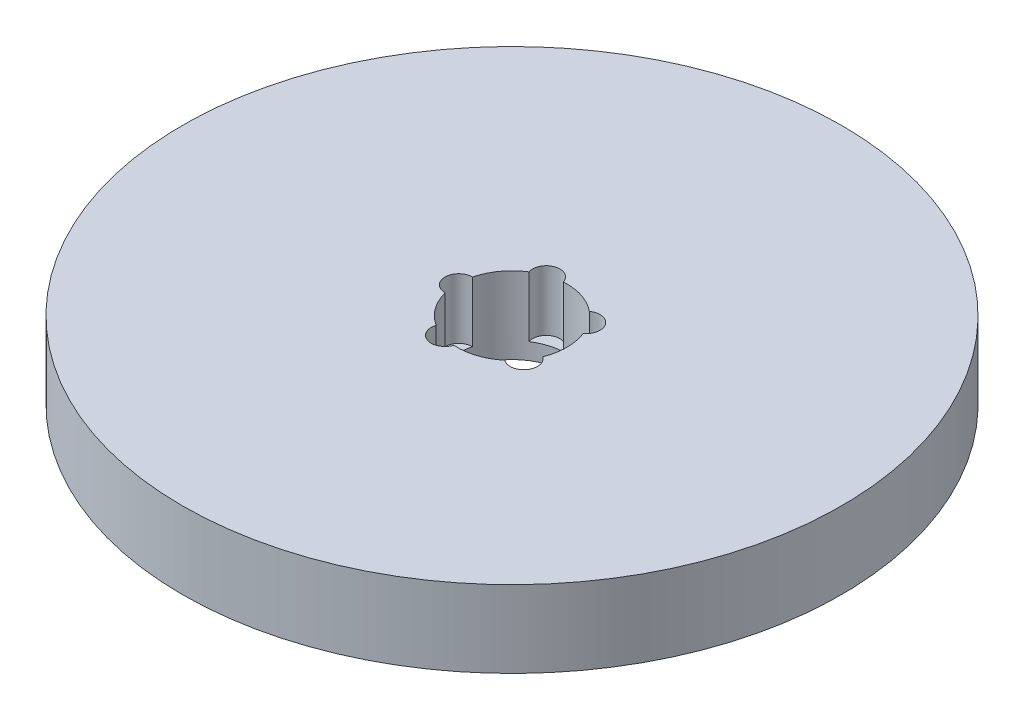
ISO-10303-21;
HEADER;
FILE_DESCRIPTION(('STEP AP214'),'2;1');
FILE_NAME('part.step','',(''),(''),'','','');
FILE_SCHEMA(('AUTOMOTIVE_DESIGN { 1 0 10303 214 1 1 1 1 }'));
ENDSEC;
DATA;
#1=APPLICATION_CONTEXT('core data for automotive mechanical design processes');
#2=APPLICATION_PROTOCOL_DEFINITION('international standard','automotive_design',2000,#1);
#3=PRODUCT_CONTEXT('',#1,'mechanical');
#4=PRODUCT('Part','Part','',(#3));
#5=PRODUCT_RELATED_PRODUCT_CATEGORY('part','',(#4));
#6=PRODUCT_DEFINITION_FORMATION('','',#4);
#7=PRODUCT_DEFINITION_CONTEXT('part definition',#1,'design');
#8=PRODUCT_DEFINITION('design','',#6,#7);
#9=PRODUCT_DEFINITION_SHAPE('','',#8);
#10=(LENGTH_UNIT() NAMED_UNIT(*) SI_UNIT(.MILLI.,.METRE.));
#11=(NAMED_UNIT(*) PLANE_ANGLE_UNIT() SI_UNIT($,.RADIAN.));
#12=(NAMED_UNIT(*) SI_UNIT($,.STERADIAN.) SOLID_ANGLE_UNIT());
#13=UNCERTAINTY_MEASURE_WITH_UNIT(LENGTH_MEASURE(1.E-05),#10,'distance_accuracy_value','');
#14=(GEOMETRIC_REPRESENTATION_CONTEXT(3) GLOBAL_UNCERTAINTY_ASSIGNED_CONTEXT((#13)) GLOBAL_UNIT_ASSIGNED_CONTEXT((#10,
#11,#12)) REPRESENTATION_CONTEXT('',''));
#15=CARTESIAN_POINT('',(0.,0.,0.));
#16=DIRECTION('',(0.,0.,1.));
#17=DIRECTION('',(1.,0.,0.));
#18=AXIS2_PLACEMENT_3D('',#15,#16,#17);
#19=CARTESIAN_POINT('',(0.,21.,0.));
#20=DIRECTION('',(0.,-1.,0.));
#21=DIRECTION('',(0.,0.,-1.));
#22=AXIS2_PLACEMENT_3D('',#19,#20,#21);
#23=CYLINDRICAL_SURFACE('',#22,90.);
#24=CARTESIAN_POINT('',(0.,21.,0.));
#25=DIRECTION('',(0.,1.,0.));
#26=DIRECTION('',(0.,0.,1.));
#27=AXIS2_PLACEMENT_3D('',#24,#25,#26);
#28=CIRCLE('',#27,90.);
#29=CARTESIAN_POINT('',(0.,21.,-90.));
#30=VERTEX_POINT('',#29);
#31=EDGE_CURVE('E157',#30,#30,#28,.T.);
#32=CARTESIAN_POINT('',(0.,0.,0.));
#33=DIRECTION('',(0.,1.,0.));
#34=DIRECTION('',(0.,0.,1.));
#35=AXIS2_PLACEMENT_3D('',#32,#33,#34);
#36=CIRCLE('',#35,90.);
#37=CARTESIAN_POINT('',(0.,0.,-90.));
#38=VERTEX_POINT('',#37);
#39=EDGE_CURVE('E150',#38,#38,#36,.T.);
#40=CARTESIAN_POINT('',(0.,21.,-90.));
#41=CARTESIAN_POINT('',(0.,20.78125,-90.));
#42=CARTESIAN_POINT('',(0.,20.5625,-90.));
#43=CARTESIAN_POINT('',(0.,20.125,-90.));
#44=CARTESIAN_POINT('',(0.,19.90625,-90.));
#45=CARTESIAN_POINT('',(0.,19.46875,-90.));
#46=CARTESIAN_POINT('',(0.,19.25,-90.));
#47=CARTESIAN_POINT('',(0.,18.8125,-90.));
#48=CARTESIAN_POINT('',(0.,18.59375,-90.));
#49=CARTESIAN_POINT('',(0.,18.15625,-90.));
#50=CARTESIAN_POINT('',(0.,17.9375,-90.));
#51=CARTESIAN_POINT('',(0.,17.5,-90.));
#52=CARTESIAN_POINT('',(0.,17.28125,-90.));
#53=CARTESIAN_POINT('',(0.,16.84375,-90.));
#54=CARTESIAN_POINT('',(0.,16.625,-90.));
#55=CARTESIAN_POINT('',(0.,16.1875,-90.));
#56=CARTESIAN_POINT('',(0.,15.96875,-90.));
#57=CARTESIAN_POINT('',(0.,15.53125,-90.));
#58=CARTESIAN_POINT('',(0.,15.3125,-90.));
#59=CARTESIAN_POINT('',(0.,14.875,-90.));
#60=CARTESIAN_POINT('',(0.,14.65625,-90.));
#61=CARTESIAN_POINT('',(0.,14.21875,-90.));
#62=CARTESIAN_POINT('',(0.,14.,-90.));
#63=CARTESIAN_POINT('',(0.,13.5625,-90.));
#64=CARTESIAN_POINT('',(0.,13.34375,-90.));
#65=CARTESIAN_POINT('',(0.,12.90625,-90.));
#66=CARTESIAN_POINT('',(0.,12.6875,-90.));
#67=CARTESIAN_POINT('',(0.,12.25,-90.));
#68=CARTESIAN_POINT('',(0.,12.03125,-90.));
#69=CARTESIAN_POINT('',(0.,11.59375,-90.));
#70=CARTESIAN_POINT('',(0.,11.375,-90.));
#71=CARTESIAN_POINT('',(0.,10.9375,-90.));
#72=CARTESIAN_POINT('',(0.,10.71875,-90.));
#73=CARTESIAN_POINT('',(0.,10.28125,-90.));
#74=CARTESIAN_POINT('',(0.,10.0625,-90.));
#75=CARTESIAN_POINT('',(0.,9.625,-90.));
#76=CARTESIAN_POINT('',(0.,9.40625,-90.));
#77=CARTESIAN_POINT('',(0.,8.96875,-90.));
#78=CARTESIAN_POINT('',(0.,8.75,-90.));
#79=CARTESIAN_POINT('',(0.,8.3125,-90.));
#80=CARTESIAN_POINT('',(0.,8.09375,-90.));
#81=CARTESIAN_POINT('',(0.,7.65625,-90.));
#82=CARTESIAN_POINT('',(0.,7.4375,-90.));
#83=CARTESIAN_POINT('',(0.,7.,-90.));
#84=CARTESIAN_POINT('',(0.,6.78125,-90.));
#85=CARTESIAN_POINT('',(0.,6.34375,-90.));
#86=CARTESIAN_POINT('',(0.,6.125,-90.));
#87=CARTESIAN_POINT('',(0.,5.6875,-90.));
#88=CARTESIAN_POINT('',(0.,5.46875,-90.));
#89=CARTESIAN_POINT('',(0.,5.03125,-90.));
#90=CARTESIAN_POINT('',(0.,4.8125,-90.));
#91=CARTESIAN_POINT('',(0.,4.375,-90.));
#92=CARTESIAN_POINT('',(0.,4.15625,-90.));
#93=CARTESIAN_POINT('',(0.,3.71875,-90.));
#94=CARTESIAN_POINT('',(0.,3.5,-90.));
#95=CARTESIAN_POINT('',(0.,3.0625,-90.));
#96=CARTESIAN_POINT('',(0.,2.84375,-90.));
#97=CARTESIAN_POINT('',(0.,2.40625,-90.));
#98=CARTESIAN_POINT('',(0.,2.1875,-90.));
#99=CARTESIAN_POINT('',(0.,1.75,-90.));
#100=CARTESIAN_POINT('',(0.,1.53125,-90.));
#101=CARTESIAN_POINT('',(0.,1.09375,-90.));
#102=CARTESIAN_POINT('',(0.,0.875000000000001,-90.));
#103=CARTESIAN_POINT('',(0.,0.4375,-90.));
#104=CARTESIAN_POINT('',(0.,0.21875,-90.));
#105=CARTESIAN_POINT('',(0.,0.,-90.));
#106=B_SPLINE_CURVE_WITH_KNOTS('',3,(#40,#41,#42,#43,#44,#45,#46,#47,#48,#49,#50,#51,#52,#53,
#54,#55,#56,#57,#58,#59,#60,#61,#62,#63,#64,#65,#66,#67,#68,#69,#70,#71,#72,#73,#74,#75,#76,#77,
#78,#79,#80,#81,#82,#83,#84,#85,#86,#87,#88,#89,#90,#91,#92,#93,#94,#95,#96,#97,#98,#99,#100,
#101,#102,#103,#104,#105),.UNSPECIFIED.,.F.,.F.,(4,2,2,2,2,2,2,2,2,2,2,2,2,2,2,2,2,2,2,2,2,2,2,
2,2,2,2,2,2,2,2,2,4),(0.,0.656250000000001,1.3125,1.96875,2.625,3.28125,3.9375,4.59375,5.25,
5.90625,6.5625,7.21875,7.875,8.53125,9.1875,9.84375,10.5,11.15625,11.8125,12.46875,13.125,
13.78125,14.4375,15.09375,15.75,16.40625,17.0625,17.71875,18.375,19.03125,19.6875,20.34375,21.),.UNSPECIFIED.);
#107=EDGE_CURVE('BSEAM39',#30,#38,#106,.T.);
#108=ORIENTED_EDGE('',*,*,#31,.F.);
#109=ORIENTED_EDGE('',*,*,#39,.T.);
#110=ORIENTED_EDGE('',*,*,#107,.T.);
#111=ORIENTED_EDGE('',*,*,#107,.F.);
#112=EDGE_LOOP('',(#108,#110,#109,#111));
#113=FACE_BOUND('',#112,.T.);
#114=ADVANCED_FACE('F39',(#113),#23,.T.);
#115=CARTESIAN_POINT('',(0.,21.,0.));
#116=DIRECTION('',(0.,1.,0.));
#117=DIRECTION('',(0.,0.,1.));
#118=AXIS2_PLACEMENT_3D('',#115,#116,#117);
#119=PLANE('',#118);
#120=CARTESIAN_POINT('',(-4.49621626958306,21.,-13.8379307924748));
#121=DIRECTION('',(0.,1.,0.));
#122=DIRECTION('',(-0.95105651629515,0.,0.309016994374958));
#123=AXIS2_PLACEMENT_3D('',#120,#121,#122);
#124=CIRCLE('',#123,3.7338312391518);
#125=CARTESIAN_POINT('',(-0.93833680600537,21.,-14.9706220324506));
#126=VERTEX_POINT('',#125);
#127=CARTESIAN_POINT('',(-8.04038042581367,21.,-12.6630281768696));
#128=VERTEX_POINT('',#127);
#129=EDGE_CURVE('E194',#126,#128,#124,.T.);
#130=ORIENTED_EDGE('',*,*,#129,.F.);
#131=CARTESIAN_POINT('',(0.,21.,0.));
#132=DIRECTION('',(0.,1.,0.));
#133=DIRECTION('',(0.,0.,1.));
#134=AXIS2_PLACEMENT_3D('',#131,#132,#133);
#135=CIRCLE('',#134,15.);
#136=CARTESIAN_POINT('',(9.55864127082486,21.,-11.5599471043636));
#137=VERTEX_POINT('',#136);
#138=EDGE_CURVE('E147',#137,#126,#135,.T.);
#139=ORIENTED_EDGE('',*,*,#138,.F.);
#140=CARTESIAN_POINT('',(11.7712470145382,21.,-8.55231156371831));
#141=DIRECTION('',(0.,1.,0.));
#142=DIRECTION('',(-0.58778525229248,0.,-0.809016994374942));
#143=AXIS2_PLACEMENT_3D('',#140,#141,#142);
#144=CIRCLE('',#143,3.7338312391518);
#145=CARTESIAN_POINT('',(13.9479456174508,21.,-5.51858795822221));
#146=VERTEX_POINT('',#145);
#147=EDGE_CURVE('E254',#146,#137,#144,.T.);
#148=ORIENTED_EDGE('',*,*,#147,.F.);
#149=CARTESIAN_POINT('',(13.9479456174509,21.,5.51858795822201));
#150=VERTEX_POINT('',#149);
#151=EDGE_CURVE('E144',#150,#146,#135,.T.);
#152=ORIENTED_EDGE('',*,*,#151,.F.);
#153=CARTESIAN_POINT('',(11.7712470145383,21.,8.55231156371814));
#154=DIRECTION('',(0.,1.,0.));
#155=DIRECTION('',(0.587785252292469,0.,-0.809016994374951));
#156=AXIS2_PLACEMENT_3D('',#153,#154,#155);
#157=CIRCLE('',#156,3.7338312391518);
#158=CARTESIAN_POINT('',(9.55864127082503,21.,11.5599471043634));
#159=VERTEX_POINT('',#158);
#160=EDGE_CURVE('E141',#159,#150,#157,.T.);
#161=ORIENTED_EDGE('',*,*,#160,.F.);
#162=CARTESIAN_POINT('',(-0.938336806005159,21.,14.9706220324506));
#163=VERTEX_POINT('',#162);
#164=EDGE_CURVE('E134',#163,#159,#135,.T.);
#165=ORIENTED_EDGE('',*,*,#164,.F.);
#166=CARTESIAN_POINT('',(-4.49621626958286,21.,13.8379307924748));
#167=DIRECTION('',(0.,1.,0.));
#168=DIRECTION('',(0.951056516295155,0.,0.309016994374945));
#169=AXIS2_PLACEMENT_3D('',#166,#167,#168);
#170=CIRCLE('',#169,3.7338312391518);
#171=CARTESIAN_POINT('',(-8.04038042581349,21.,12.6630281768697));
#172=VERTEX_POINT('',#171);
#173=EDGE_CURVE('E111',#172,#163,#170,.T.);
#174=ORIENTED_EDGE('',*,*,#173,.F.);
#175=CARTESIAN_POINT('',(-14.5278696564571,21.,3.73376529056043));
#176=VERTEX_POINT('',#175);
#177=EDGE_CURVE('E145',#176,#172,#135,.T.);
#178=ORIENTED_EDGE('',*,*,#177,.F.);
#179=CARTESIAN_POINT('',(-14.5500614899108,21.,0.));
#180=DIRECTION('',(0.,1.,0.));
#181=DIRECTION('',(0.,0.,1.));
#182=AXIS2_PLACEMENT_3D('',#179,#180,#181);
#183=CIRCLE('',#182,3.7338312391518);
#184=CARTESIAN_POINT('',(-14.5278696564571,21.,-3.73376529056043));
#185=VERTEX_POINT('',#184);
#186=EDGE_CURVE('E153',#185,#176,#183,.T.);
#187=ORIENTED_EDGE('',*,*,#186,.F.);
#188=EDGE_CURVE('E146',#128,#185,#135,.T.);
#189=ORIENTED_EDGE('',*,*,#188,.F.);
#190=EDGE_LOOP('',(#130,#139,#148,#152,#161,#165,#174,#178,#187,#189));
#191=FACE_BOUND('',#190,.T.);
#192=ORIENTED_EDGE('',*,*,#31,.T.);
#193=EDGE_LOOP('',(#192));
#194=FACE_BOUND('',#193,.T.);
#195=ADVANCED_FACE('F139',(#191,#194),#119,.T.);
#196=CARTESIAN_POINT('',(0.,0.,0.));
#197=DIRECTION('',(0.,1.,0.));
#198=DIRECTION('',(0.,0.,1.));
#199=AXIS2_PLACEMENT_3D('',#196,#197,#198);
#200=PLANE('',#199);
#201=CARTESIAN_POINT('',(0.,0.,0.));
#202=DIRECTION('',(0.,1.,0.));
#203=DIRECTION('',(0.,0.,1.));
#204=AXIS2_PLACEMENT_3D('',#201,#202,#203);
#205=CIRCLE('',#204,15.);
#206=CARTESIAN_POINT('',(0.,0.,15.));
#207=VERTEX_POINT('',#206);
#208=EDGE_CURVE('E154',#207,#207,#205,.T.);
#209=ORIENTED_EDGE('',*,*,#208,.T.);
#210=EDGE_LOOP('',(#209));
#211=FACE_BOUND('',#210,.T.);
#212=ORIENTED_EDGE('',*,*,#39,.F.);
#213=EDGE_LOOP('',(#212));
#214=FACE_BOUND('',#213,.T.);
#215=ADVANCED_FACE('F213',(#211,#214),#200,.F.);
#216=CARTESIAN_POINT('',(0.,21.,0.));
#217=DIRECTION('',(0.,-1.,0.));
#218=DIRECTION('',(0.,0.,-1.));
#219=AXIS2_PLACEMENT_3D('',#216,#217,#218);
#220=CYLINDRICAL_SURFACE('',#219,15.);
#221=DIRECTION('',(0.,1.,0.));
#222=VECTOR('',#221,1.);
#223=CARTESIAN_POINT('',(-0.938336806005371,12.7563726104581,-14.9706220324506));
#224=LINE('',#223,#222);
#225=CARTESIAN_POINT('',(-0.93833680600537,4.51274522091627,-14.9706220324506));
#226=VERTEX_POINT('',#225);
#227=EDGE_CURVE('E11',#226,#126,#224,.T.);
#228=ORIENTED_EDGE('',*,*,#227,.F.);
#229=CARTESIAN_POINT('',(0.,4.51274522091627,0.));
#230=DIRECTION('',(0.,1.,0.));
#231=DIRECTION('',(0.,0.,1.));
#232=AXIS2_PLACEMENT_3D('',#229,#230,#231);
#233=CIRCLE('',#232,15.);
#234=CARTESIAN_POINT('',(-8.04038042581367,4.51274522091627,-12.6630281768696));
#235=VERTEX_POINT('',#234);
#236=EDGE_CURVE('E189',#226,#235,#233,.T.);
#237=ORIENTED_EDGE('',*,*,#236,.T.);
#238=DIRECTION('',(0.,1.,0.));
#239=VECTOR('',#238,1.);
#240=CARTESIAN_POINT('',(-8.04038042581367,12.7563726104581,-12.6630281768696));
#241=LINE('',#240,#239);
#242=EDGE_CURVE('E46',#128,#235,#241,.F.);
#243=ORIENTED_EDGE('',*,*,#242,.F.);
#244=ORIENTED_EDGE('',*,*,#188,.T.);
#245=DIRECTION('',(0.,1.,0.));
#246=VECTOR('',#245,1.);
#247=CARTESIAN_POINT('',(-14.5278696564571,12.7563726104581,-3.73376529056043));
#248=LINE('',#247,#246);
#249=CARTESIAN_POINT('',(-14.5278696564571,4.51274522091627,-3.73376529056043));
#250=VERTEX_POINT('',#249);
#251=EDGE_CURVE('E168',#250,#185,#248,.T.);
#252=ORIENTED_EDGE('',*,*,#251,.F.);
#253=CARTESIAN_POINT('',(0.,4.51274522091627,0.));
#254=DIRECTION('',(0.,1.,0.));
#255=DIRECTION('',(0.,0.,1.));
#256=AXIS2_PLACEMENT_3D('',#253,#254,#255);
#257=CIRCLE('',#256,15.);
#258=CARTESIAN_POINT('',(-14.5278696564571,4.51274522091627,3.73376529056043));
#259=VERTEX_POINT('',#258);
#260=EDGE_CURVE('E165',#250,#259,#257,.T.);
#261=ORIENTED_EDGE('',*,*,#260,.T.);
#262=DIRECTION('',(0.,1.,0.));
#263=VECTOR('',#262,1.);
#264=CARTESIAN_POINT('',(-14.5278696564571,12.7563726104581,3.73376529056043));
#265=LINE('',#264,#263);
#266=EDGE_CURVE('E170',#176,#259,#265,.F.);
#267=ORIENTED_EDGE('',*,*,#266,.F.);
#268=ORIENTED_EDGE('',*,*,#177,.T.);
#269=DIRECTION('',(0.,1.,0.));
#270=VECTOR('',#269,1.);
#271=CARTESIAN_POINT('',(-8.04038042581349,12.7563726104581,12.6630281768697));
#272=LINE('',#271,#270);
#273=CARTESIAN_POINT('',(-8.04038042581349,4.51274522091627,12.6630281768697));
#274=VERTEX_POINT('',#273);
#275=EDGE_CURVE('E121',#274,#172,#272,.T.);
#276=ORIENTED_EDGE('',*,*,#275,.F.);
#277=CARTESIAN_POINT('',(0.,4.51274522091627,0.));
#278=DIRECTION('',(0.,1.,0.));
#279=DIRECTION('',(0.,0.,1.));
#280=AXIS2_PLACEMENT_3D('',#277,#278,#279);
#281=CIRCLE('',#280,15.);
#282=CARTESIAN_POINT('',(-0.938336806005159,4.51274522091627,14.9706220324506));
#283=VERTEX_POINT('',#282);
#284=EDGE_CURVE('E136',#274,#283,#281,.T.);
#285=ORIENTED_EDGE('',*,*,#284,.T.);
#286=DIRECTION('',(0.,1.,0.));
#287=VECTOR('',#286,1.);
#288=CARTESIAN_POINT('',(-0.938336806005159,12.7563726104581,14.9706220324506));
#289=LINE('',#288,#287);
#290=EDGE_CURVE('E117',#163,#283,#289,.F.);
#291=ORIENTED_EDGE('',*,*,#290,.F.);
#292=ORIENTED_EDGE('',*,*,#164,.T.);
#293=DIRECTION('',(0.,1.,0.));
#294=VECTOR('',#293,1.);
#295=CARTESIAN_POINT('',(9.55864127082503,12.7563726104581,11.5599471043634));
#296=LINE('',#295,#294);
#297=CARTESIAN_POINT('',(9.55864127082503,4.51274522091627,11.5599471043634));
#298=VERTEX_POINT('',#297);
#299=EDGE_CURVE('E182',#298,#159,#296,.T.);
#300=ORIENTED_EDGE('',*,*,#299,.F.);
#301=CARTESIAN_POINT('',(0.,4.51274522091627,0.));
#302=DIRECTION('',(0.,1.,0.));
#303=DIRECTION('',(0.,0.,1.));
#304=AXIS2_PLACEMENT_3D('',#301,#302,#303);
#305=CIRCLE('',#304,15.);
#306=CARTESIAN_POINT('',(13.9479456174509,4.51274522091627,5.51858795822201));
#307=VERTEX_POINT('',#306);
#308=EDGE_CURVE('E174',#298,#307,#305,.T.);
#309=ORIENTED_EDGE('',*,*,#308,.T.);
#310=DIRECTION('',(0.,1.,0.));
#311=VECTOR('',#310,1.);
#312=CARTESIAN_POINT('',(13.9479456174509,12.7563726104581,5.518587958222));
#313=LINE('',#312,#311);
#314=EDGE_CURVE('E177',#150,#307,#313,.F.);
#315=ORIENTED_EDGE('',*,*,#314,.F.);
#316=ORIENTED_EDGE('',*,*,#151,.T.);
#317=DIRECTION('',(0.,1.,0.));
#318=VECTOR('',#317,1.);
#319=CARTESIAN_POINT('',(13.9479456174508,12.7563726104581,-5.51858795822221));
#320=LINE('',#319,#318);
#321=CARTESIAN_POINT('',(13.9479456174508,4.51274522091627,-5.51858795822221));
#322=VERTEX_POINT('',#321);
#323=EDGE_CURVE('E187',#322,#146,#320,.T.);
#324=ORIENTED_EDGE('',*,*,#323,.F.);
#325=CARTESIAN_POINT('',(0.,4.51274522091627,0.));
#326=DIRECTION('',(0.,1.,0.));
#327=DIRECTION('',(0.,0.,1.));
#328=AXIS2_PLACEMENT_3D('',#325,#326,#327);
#329=CIRCLE('',#328,15.);
#330=CARTESIAN_POINT('',(9.55864127082486,4.51274522091627,-11.5599471043636));
#331=VERTEX_POINT('',#330);
#332=EDGE_CURVE('E181',#322,#331,#329,.T.);
#333=ORIENTED_EDGE('',*,*,#332,.T.);
#334=DIRECTION('',(0.,1.,0.));
#335=VECTOR('',#334,1.);
#336=CARTESIAN_POINT('',(9.55864127082486,12.7563726104581,-11.5599471043636));
#337=LINE('',#336,#335);
#338=EDGE_CURVE('E186',#137,#331,#337,.F.);
#339=ORIENTED_EDGE('',*,*,#338,.F.);
#340=ORIENTED_EDGE('',*,*,#138,.T.);
#341=EDGE_LOOP('',(#228,#237,#243,#244,#252,#261,#267,#268,#276,#285,#291,#292,#300,#309,#315,
#316,#324,#333,#339,#340));
#342=FACE_BOUND('',#341,.T.);
#343=ORIENTED_EDGE('',*,*,#208,.F.);
#344=EDGE_LOOP('',(#343));
#345=FACE_BOUND('',#344,.T.);
#346=ADVANCED_FACE('F135',(#342,#345),#220,.F.);
#347=CARTESIAN_POINT('',(-14.5500614899108,4.51274522091627,0.));
#348=DIRECTION('',(0.,1.,0.));
#349=DIRECTION('',(0.,0.,1.));
#350=AXIS2_PLACEMENT_3D('',#347,#348,#349);
#351=CYLINDRICAL_SURFACE('',#350,3.7338312391518);
#352=ORIENTED_EDGE('',*,*,#251,.T.);
#353=ORIENTED_EDGE('',*,*,#186,.T.);
#354=ORIENTED_EDGE('',*,*,#266,.T.);
#355=CARTESIAN_POINT('',(-14.5500614899108,4.51274522091627,0.));
#356=DIRECTION('',(0.,1.,0.));
#357=DIRECTION('',(0.,0.,1.));
#358=AXIS2_PLACEMENT_3D('',#355,#356,#357);
#359=CIRCLE('',#358,3.7338312391518);
#360=EDGE_CURVE('E158',#250,#259,#359,.T.);
#361=ORIENTED_EDGE('',*,*,#360,.F.);
#362=EDGE_LOOP('',(#352,#353,#354,#361));
#363=FACE_BOUND('',#362,.T.);
#364=ADVANCED_FACE('F221',(#363),#351,.F.);
#365=CARTESIAN_POINT('',(-14.5500614899108,4.51274522091627,0.));
#366=DIRECTION('',(0.,1.,0.));
#367=DIRECTION('',(0.,0.,1.));
#368=AXIS2_PLACEMENT_3D('',#365,#366,#367);
#369=PLANE('',#368);
#370=ORIENTED_EDGE('',*,*,#360,.T.);
#371=ORIENTED_EDGE('',*,*,#260,.F.);
#372=EDGE_LOOP('',(#370,#371));
#373=FACE_BOUND('',#372,.T.);
#374=ADVANCED_FACE('F227',(#373),#369,.T.);
#375=CARTESIAN_POINT('',(-4.49621626958286,4.51274522091627,13.8379307924748));
#376=DIRECTION('',(0.,1.,0.));
#377=DIRECTION('',(0.,0.,1.));
#378=AXIS2_PLACEMENT_3D('',#375,#376,#377);
#379=CYLINDRICAL_SURFACE('',#378,3.7338312391518);
#380=ORIENTED_EDGE('',*,*,#275,.T.);
#381=ORIENTED_EDGE('',*,*,#173,.T.);
#382=ORIENTED_EDGE('',*,*,#290,.T.);
#383=CARTESIAN_POINT('',(-4.49621626958286,4.51274522091627,13.8379307924748));
#384=DIRECTION('',(0.,1.,0.));
#385=DIRECTION('',(0.951056516295155,0.,0.309016994374945));
#386=AXIS2_PLACEMENT_3D('',#383,#384,#385);
#387=CIRCLE('',#386,3.7338312391518);
#388=EDGE_CURVE('E127',#274,#283,#387,.T.);
#389=ORIENTED_EDGE('',*,*,#388,.F.);
#390=EDGE_LOOP('',(#380,#381,#382,#389));
#391=FACE_BOUND('',#390,.T.);
#392=ADVANCED_FACE('F116',(#391),#379,.F.);
#393=CARTESIAN_POINT('',(-4.49621626958286,4.51274522091627,13.8379307924748));
#394=DIRECTION('',(0.,1.,0.));
#395=DIRECTION('',(0.951056516295155,0.,0.309016994374945));
#396=AXIS2_PLACEMENT_3D('',#393,#394,#395);
#397=PLANE('',#396);
#398=ORIENTED_EDGE('',*,*,#388,.T.);
#399=ORIENTED_EDGE('',*,*,#284,.F.);
#400=EDGE_LOOP('',(#398,#399));
#401=FACE_BOUND('',#400,.T.);
#402=ADVANCED_FACE('F234',(#401),#397,.T.);
#403=CARTESIAN_POINT('',(11.7712470145383,4.51274522091627,8.55231156371814));
#404=DIRECTION('',(0.,1.,0.));
#405=DIRECTION('',(0.,0.,1.));
#406=AXIS2_PLACEMENT_3D('',#403,#404,#405);
#407=CYLINDRICAL_SURFACE('',#406,3.7338312391518);
#408=ORIENTED_EDGE('',*,*,#299,.T.);
#409=ORIENTED_EDGE('',*,*,#160,.T.);
#410=ORIENTED_EDGE('',*,*,#314,.T.);
#411=CARTESIAN_POINT('',(11.7712470145383,4.51274522091627,8.55231156371814));
#412=DIRECTION('',(0.,1.,0.));
#413=DIRECTION('',(0.587785252292469,0.,-0.809016994374951));
#414=AXIS2_PLACEMENT_3D('',#411,#412,#413);
#415=CIRCLE('',#414,3.7338312391518);
#416=EDGE_CURVE('E130',#298,#307,#415,.T.);
#417=ORIENTED_EDGE('',*,*,#416,.F.);
#418=EDGE_LOOP('',(#408,#409,#410,#417));
#419=FACE_BOUND('',#418,.T.);
#420=ADVANCED_FACE('F240',(#419),#407,.F.);
#421=CARTESIAN_POINT('',(11.7712470145383,4.51274522091627,8.55231156371814));
#422=DIRECTION('',(0.,1.,0.));
#423=DIRECTION('',(0.587785252292469,0.,-0.809016994374951));
#424=AXIS2_PLACEMENT_3D('',#421,#422,#423);
#425=PLANE('',#424);
#426=ORIENTED_EDGE('',*,*,#416,.T.);
#427=ORIENTED_EDGE('',*,*,#308,.F.);
#428=EDGE_LOOP('',(#426,#427));
#429=FACE_BOUND('',#428,.T.);
#430=ADVANCED_FACE('F245',(#429),#425,.T.);
#431=CARTESIAN_POINT('',(11.7712470145382,4.51274522091627,-8.55231156371831));
#432=DIRECTION('',(0.,1.,0.));
#433=DIRECTION('',(0.,0.,1.));
#434=AXIS2_PLACEMENT_3D('',#431,#432,#433);
#435=CYLINDRICAL_SURFACE('',#434,3.7338312391518);
#436=ORIENTED_EDGE('',*,*,#323,.T.);
#437=ORIENTED_EDGE('',*,*,#147,.T.);
#438=ORIENTED_EDGE('',*,*,#338,.T.);
#439=CARTESIAN_POINT('',(11.7712470145382,4.51274522091627,-8.55231156371831));
#440=DIRECTION('',(0.,1.,0.));
#441=DIRECTION('',(-0.58778525229248,0.,-0.809016994374942));
#442=AXIS2_PLACEMENT_3D('',#439,#440,#441);
#443=CIRCLE('',#442,3.7338312391518);
#444=EDGE_CURVE('E56',#322,#331,#443,.T.);
#445=ORIENTED_EDGE('',*,*,#444,.F.);
#446=EDGE_LOOP('',(#436,#437,#438,#445));
#447=FACE_BOUND('',#446,.T.);
#448=ADVANCED_FACE('F266',(#447),#435,.F.);
#449=CARTESIAN_POINT('',(11.7712470145382,4.51274522091627,-8.55231156371831));
#450=DIRECTION('',(0.,1.,0.));
#451=DIRECTION('',(-0.58778525229248,0.,-0.809016994374942));
#452=AXIS2_PLACEMENT_3D('',#449,#450,#451);
#453=PLANE('',#452);
#454=ORIENTED_EDGE('',*,*,#444,.T.);
#455=ORIENTED_EDGE('',*,*,#332,.F.);
#456=EDGE_LOOP('',(#454,#455));
#457=FACE_BOUND('',#456,.T.);
#458=ADVANCED_FACE('F204',(#457),#453,.T.);
#459=CARTESIAN_POINT('',(-4.49621626958306,4.51274522091627,-13.8379307924748));
#460=DIRECTION('',(0.,1.,0.));
#461=DIRECTION('',(0.,0.,1.));
#462=AXIS2_PLACEMENT_3D('',#459,#460,#461);
#463=CYLINDRICAL_SURFACE('',#462,3.7338312391518);
#464=ORIENTED_EDGE('',*,*,#227,.T.);
#465=ORIENTED_EDGE('',*,*,#129,.T.);
#466=ORIENTED_EDGE('',*,*,#242,.T.);
#467=CARTESIAN_POINT('',(-4.49621626958306,4.51274522091627,-13.8379307924748));
#468=DIRECTION('',(0.,1.,0.));
#469=DIRECTION('',(-0.95105651629515,0.,0.309016994374958));
#470=AXIS2_PLACEMENT_3D('',#467,#468,#469);
#471=CIRCLE('',#470,3.7338312391518);
#472=EDGE_CURVE('E55',#226,#235,#471,.T.);
#473=ORIENTED_EDGE('',*,*,#472,.F.);
#474=EDGE_LOOP('',(#464,#465,#466,#473));
#475=FACE_BOUND('',#474,.T.);
#476=ADVANCED_FACE('F193',(#475),#463,.F.);
#477=CARTESIAN_POINT('',(-4.49621626958306,4.51274522091627,-13.8379307924748));
#478=DIRECTION('',(0.,1.,0.));
#479=DIRECTION('',(-0.95105651629515,0.,0.309016994374958));
#480=AXIS2_PLACEMENT_3D('',#477,#478,#479);
#481=PLANE('',#480);
#482=ORIENTED_EDGE('',*,*,#472,.T.);
#483=ORIENTED_EDGE('',*,*,#236,.F.);
#484=EDGE_LOOP('',(#482,#483));
#485=FACE_BOUND('',#484,.T.);
#486=ADVANCED_FACE('F196',(#485),#481,.T.);
#487=CLOSED_SHELL('',(#114,#195,#215,#346,#364,#374,#392,#402,#420,#430,#448,#458,#476,#486));
#488=MANIFOLD_SOLID_BREP('B2',#487);
#489=ADVANCED_BREP_SHAPE_REPRESENTATION('',(#18,#488),#14);
#490=SHAPE_DEFINITION_REPRESENTATION(#9,#489);
ENDSEC;
END-ISO-10303-21;
